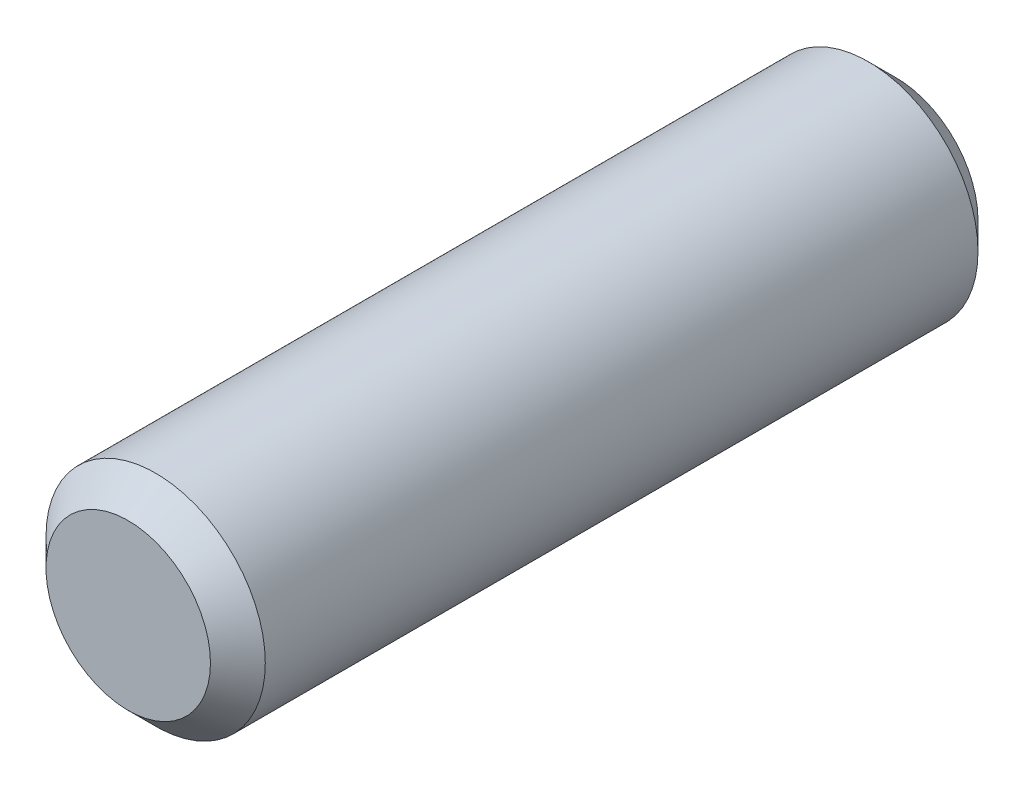
ISO-10303-21;
HEADER;
FILE_DESCRIPTION(('STEP AP214'),'2;1');
FILE_NAME('part.step','',(''),(''),'','','');
FILE_SCHEMA(('AUTOMOTIVE_DESIGN { 1 0 10303 214 1 1 1 1 }'));
ENDSEC;
DATA;
#1=APPLICATION_CONTEXT('core data for automotive mechanical design processes');
#2=APPLICATION_PROTOCOL_DEFINITION('international standard','automotive_design',2000,#1);
#3=PRODUCT_CONTEXT('',#1,'mechanical');
#4=PRODUCT('Part','Part','',(#3));
#5=PRODUCT_RELATED_PRODUCT_CATEGORY('part','',(#4));
#6=PRODUCT_DEFINITION_FORMATION('','',#4);
#7=PRODUCT_DEFINITION_CONTEXT('part definition',#1,'design');
#8=PRODUCT_DEFINITION('design','',#6,#7);
#9=PRODUCT_DEFINITION_SHAPE('','',#8);
#10=(LENGTH_UNIT() NAMED_UNIT(*) SI_UNIT(.MILLI.,.METRE.));
#11=(NAMED_UNIT(*) PLANE_ANGLE_UNIT() SI_UNIT($,.RADIAN.));
#12=(NAMED_UNIT(*) SI_UNIT($,.STERADIAN.) SOLID_ANGLE_UNIT());
#13=UNCERTAINTY_MEASURE_WITH_UNIT(LENGTH_MEASURE(1.E-05),#10,'distance_accuracy_value','');
#14=(GEOMETRIC_REPRESENTATION_CONTEXT(3) GLOBAL_UNCERTAINTY_ASSIGNED_CONTEXT((#13)) GLOBAL_UNIT_ASSIGNED_CONTEXT((#10,
#11,#12)) REPRESENTATION_CONTEXT('',''));
#15=CARTESIAN_POINT('',(0.,0.,0.));
#16=DIRECTION('',(0.,0.,1.));
#17=DIRECTION('',(1.,0.,0.));
#18=AXIS2_PLACEMENT_3D('',#15,#16,#17);
#19=CARTESIAN_POINT('',(0.,0.,7.));
#20=DIRECTION('',(0.,0.,-1.));
#21=DIRECTION('',(-1.,0.,0.));
#22=AXIS2_PLACEMENT_3D('',#19,#20,#21);
#23=CYLINDRICAL_SURFACE('',#22,2.);
#24=CARTESIAN_POINT('',(0.,0.,-6.5));
#25=DIRECTION('',(0.,0.,1.));
#26=DIRECTION('',(1.,0.,0.));
#27=AXIS2_PLACEMENT_3D('',#24,#25,#26);
#28=CIRCLE('',#27,2.);
#29=CARTESIAN_POINT('',(2.,0.,-6.5));
#30=VERTEX_POINT('',#29);
#31=EDGE_CURVE('E27',#30,#30,#28,.T.);
#32=ORIENTED_EDGE('',*,*,#31,.T.);
#33=EDGE_LOOP('',(#32));
#34=FACE_BOUND('',#33,.T.);
#35=CARTESIAN_POINT('',(0.,0.,6.5));
#36=DIRECTION('',(0.,0.,1.));
#37=DIRECTION('',(1.,0.,0.));
#38=AXIS2_PLACEMENT_3D('',#35,#36,#37);
#39=CIRCLE('',#38,2.);
#40=CARTESIAN_POINT('',(2.,0.,6.5));
#41=VERTEX_POINT('',#40);
#42=EDGE_CURVE('E31',#41,#41,#39,.F.);
#43=ORIENTED_EDGE('',*,*,#42,.T.);
#44=EDGE_LOOP('',(#43));
#45=FACE_BOUND('',#44,.T.);
#46=ADVANCED_FACE('F15',(#34,#45),#23,.T.);
#47=CARTESIAN_POINT('',(0.,0.,7.));
#48=DIRECTION('',(0.,0.,1.));
#49=DIRECTION('',(1.,0.,0.));
#50=AXIS2_PLACEMENT_3D('',#47,#48,#49);
#51=PLANE('',#50);
#52=CARTESIAN_POINT('',(0.,0.,7.));
#53=DIRECTION('',(0.,0.,1.));
#54=DIRECTION('',(1.,0.,0.));
#55=AXIS2_PLACEMENT_3D('',#52,#53,#54);
#56=CIRCLE('',#55,1.5);
#57=CARTESIAN_POINT('',(1.5,0.,7.));
#58=VERTEX_POINT('',#57);
#59=EDGE_CURVE('E10',#58,#58,#56,.T.);
#60=ORIENTED_EDGE('',*,*,#59,.T.);
#61=EDGE_LOOP('',(#60));
#62=FACE_BOUND('',#61,.T.);
#63=ADVANCED_FACE('F49',(#62),#51,.T.);
#64=CARTESIAN_POINT('',(0.,0.,-7.));
#65=DIRECTION('',(0.,0.,1.));
#66=DIRECTION('',(1.,0.,0.));
#67=AXIS2_PLACEMENT_3D('',#64,#65,#66);
#68=PLANE('',#67);
#69=CARTESIAN_POINT('',(0.,0.,-7.));
#70=DIRECTION('',(0.,0.,1.));
#71=DIRECTION('',(1.,0.,0.));
#72=AXIS2_PLACEMENT_3D('',#69,#70,#71);
#73=CIRCLE('',#72,1.5);
#74=CARTESIAN_POINT('',(1.5,0.,-7.));
#75=VERTEX_POINT('',#74);
#76=EDGE_CURVE('E23',#75,#75,#73,.F.);
#77=ORIENTED_EDGE('',*,*,#76,.T.);
#78=EDGE_LOOP('',(#77));
#79=FACE_BOUND('',#78,.T.);
#80=ADVANCED_FACE('F46',(#79),#68,.F.);
#81=CARTESIAN_POINT('',(0.,0.,-6.5));
#82=DIRECTION('',(0.,0.,1.));
#83=DIRECTION('',(1.,0.,0.));
#84=AXIS2_PLACEMENT_3D('',#81,#82,#83);
#85=CONICAL_SURFACE('',#84,2.,0.785398163397448);
#86=ORIENTED_EDGE('',*,*,#76,.F.);
#87=EDGE_LOOP('',(#86));
#88=FACE_BOUND('',#87,.T.);
#89=ORIENTED_EDGE('',*,*,#31,.F.);
#90=EDGE_LOOP('',(#89));
#91=FACE_BOUND('',#90,.T.);
#92=ADVANCED_FACE('F40',(#88,#91),#85,.T.);
#93=CARTESIAN_POINT('',(0.,0.,7.));
#94=DIRECTION('',(0.,0.,-1.));
#95=DIRECTION('',(-1.,0.,0.));
#96=AXIS2_PLACEMENT_3D('',#93,#94,#95);
#97=CONICAL_SURFACE('',#96,1.5,0.785398163397446);
#98=ORIENTED_EDGE('',*,*,#42,.F.);
#99=EDGE_LOOP('',(#98));
#100=FACE_BOUND('',#99,.T.);
#101=ORIENTED_EDGE('',*,*,#59,.F.);
#102=EDGE_LOOP('',(#101));
#103=FACE_BOUND('',#102,.T.);
#104=ADVANCED_FACE('F18',(#100,#103),#97,.T.);
#105=CLOSED_SHELL('',(#46,#63,#80,#92,#104));
#106=MANIFOLD_SOLID_BREP('B1',#105);
#107=ADVANCED_BREP_SHAPE_REPRESENTATION('',(#18,#106),#14);
#108=SHAPE_DEFINITION_REPRESENTATION(#9,#107);
ENDSEC;
END-ISO-10303-21;
